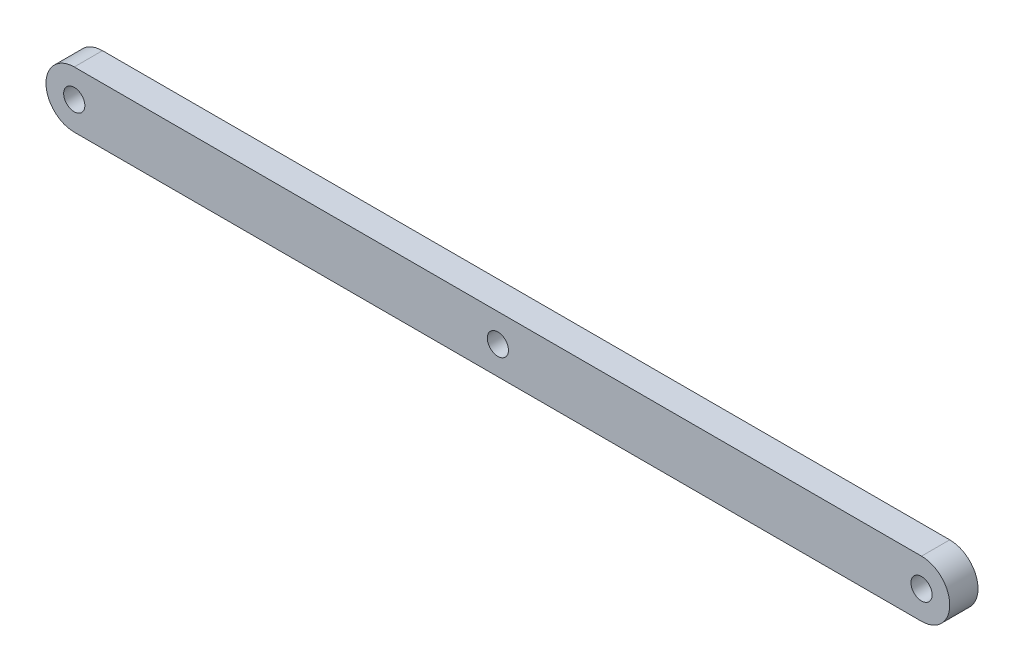
ISO-10303-21;
HEADER;
FILE_DESCRIPTION(('STEP AP214'),'2;1');
FILE_NAME('part.step','',(''),(''),'','','');
FILE_SCHEMA(('AUTOMOTIVE_DESIGN { 1 0 10303 214 1 1 1 1 }'));
ENDSEC;
DATA;
#1=APPLICATION_CONTEXT('core data for automotive mechanical design processes');
#2=APPLICATION_PROTOCOL_DEFINITION('international standard','automotive_design',2000,#1);
#3=PRODUCT_CONTEXT('',#1,'mechanical');
#4=PRODUCT('Part','Part','',(#3));
#5=PRODUCT_RELATED_PRODUCT_CATEGORY('part','',(#4));
#6=PRODUCT_DEFINITION_FORMATION('','',#4);
#7=PRODUCT_DEFINITION_CONTEXT('part definition',#1,'design');
#8=PRODUCT_DEFINITION('design','',#6,#7);
#9=PRODUCT_DEFINITION_SHAPE('','',#8);
#10=(LENGTH_UNIT() NAMED_UNIT(*) SI_UNIT(.MILLI.,.METRE.));
#11=(NAMED_UNIT(*) PLANE_ANGLE_UNIT() SI_UNIT($,.RADIAN.));
#12=(NAMED_UNIT(*) SI_UNIT($,.STERADIAN.) SOLID_ANGLE_UNIT());
#13=UNCERTAINTY_MEASURE_WITH_UNIT(LENGTH_MEASURE(1.E-05),#10,'distance_accuracy_value','');
#14=(GEOMETRIC_REPRESENTATION_CONTEXT(3) GLOBAL_UNCERTAINTY_ASSIGNED_CONTEXT((#13)) GLOBAL_UNIT_ASSIGNED_CONTEXT((#10,
#11,#12)) REPRESENTATION_CONTEXT('',''));
#15=CARTESIAN_POINT('',(0.,0.,0.));
#16=DIRECTION('',(0.,0.,1.));
#17=DIRECTION('',(1.,0.,0.));
#18=AXIS2_PLACEMENT_3D('',#15,#16,#17);
#19=CARTESIAN_POINT('',(0.,20.,-20.));
#20=DIRECTION('',(0.,0.,1.));
#21=DIRECTION('',(1.,0.,0.));
#22=AXIS2_PLACEMENT_3D('',#19,#20,#21);
#23=CYLINDRICAL_SURFACE('',#22,20.);
#24=CARTESIAN_POINT('',(0.,20.,0.));
#25=DIRECTION('',(0.,0.,1.));
#26=DIRECTION('',(1.,0.,0.));
#27=AXIS2_PLACEMENT_3D('',#24,#25,#26);
#28=CIRCLE('',#27,20.);
#29=CARTESIAN_POINT('',(0.,40.,0.));
#30=VERTEX_POINT('',#29);
#31=CARTESIAN_POINT('',(0.,0.,0.));
#32=VERTEX_POINT('',#31);
#33=EDGE_CURVE('E84',#30,#32,#28,.T.);
#34=ORIENTED_EDGE('',*,*,#33,.F.);
#35=DIRECTION('',(0.,0.,1.));
#36=VECTOR('',#35,1.);
#37=CARTESIAN_POINT('',(0.,40.,-20.));
#38=LINE('',#37,#36);
#39=CARTESIAN_POINT('',(0.,40.,-20.));
#40=VERTEX_POINT('',#39);
#41=EDGE_CURVE('E11',#40,#30,#38,.T.);
#42=ORIENTED_EDGE('',*,*,#41,.F.);
#43=CARTESIAN_POINT('',(0.,20.,-20.));
#44=DIRECTION('',(0.,0.,1.));
#45=DIRECTION('',(1.,0.,0.));
#46=AXIS2_PLACEMENT_3D('',#43,#44,#45);
#47=CIRCLE('',#46,20.);
#48=CARTESIAN_POINT('',(0.,0.,-20.));
#49=VERTEX_POINT('',#48);
#50=EDGE_CURVE('E77',#40,#49,#47,.T.);
#51=ORIENTED_EDGE('',*,*,#50,.T.);
#52=DIRECTION('',(0.,0.,1.));
#53=VECTOR('',#52,1.);
#54=CARTESIAN_POINT('',(0.,0.,-20.));
#55=LINE('',#54,#53);
#56=EDGE_CURVE('E22',#49,#32,#55,.T.);
#57=ORIENTED_EDGE('',*,*,#56,.T.);
#58=EDGE_LOOP('',(#34,#42,#51,#57));
#59=FACE_BOUND('',#58,.T.);
#60=ADVANCED_FACE('F19',(#59),#23,.T.);
#61=CARTESIAN_POINT('',(0.,40.,-20.));
#62=DIRECTION('',(0.,1.,0.));
#63=DIRECTION('',(0.,0.,1.));
#64=AXIS2_PLACEMENT_3D('',#61,#62,#63);
#65=PLANE('',#64);
#66=DIRECTION('',(-1.,0.,0.));
#67=VECTOR('',#66,1.);
#68=CARTESIAN_POINT('',(0.,40.,0.));
#69=LINE('',#68,#67);
#70=CARTESIAN_POINT('',(600.,40.,0.));
#71=VERTEX_POINT('',#70);
#72=EDGE_CURVE('E79',#71,#30,#69,.T.);
#73=ORIENTED_EDGE('',*,*,#72,.F.);
#74=DIRECTION('',(0.,0.,1.));
#75=VECTOR('',#74,1.);
#76=CARTESIAN_POINT('',(600.,40.,-20.));
#77=LINE('',#76,#75);
#78=CARTESIAN_POINT('',(600.,40.,-20.));
#79=VERTEX_POINT('',#78);
#80=EDGE_CURVE('E28',#79,#71,#77,.T.);
#81=ORIENTED_EDGE('',*,*,#80,.F.);
#82=DIRECTION('',(-1.,0.,0.));
#83=VECTOR('',#82,1.);
#84=CARTESIAN_POINT('',(0.,40.,-20.));
#85=LINE('',#84,#83);
#86=EDGE_CURVE('E74',#79,#40,#85,.T.);
#87=ORIENTED_EDGE('',*,*,#86,.T.);
#88=ORIENTED_EDGE('',*,*,#41,.T.);
#89=EDGE_LOOP('',(#73,#81,#87,#88));
#90=FACE_BOUND('',#89,.T.);
#91=ADVANCED_FACE('F95',(#90),#65,.T.);
#92=CARTESIAN_POINT('',(600.,20.,-20.));
#93=DIRECTION('',(0.,0.,1.));
#94=DIRECTION('',(1.,0.,0.));
#95=AXIS2_PLACEMENT_3D('',#92,#93,#94);
#96=CYLINDRICAL_SURFACE('',#95,20.);
#97=CARTESIAN_POINT('',(600.,20.,0.));
#98=DIRECTION('',(0.,0.,1.));
#99=DIRECTION('',(1.,0.,0.));
#100=AXIS2_PLACEMENT_3D('',#97,#98,#99);
#101=CIRCLE('',#100,20.);
#102=CARTESIAN_POINT('',(600.,0.,0.));
#103=VERTEX_POINT('',#102);
#104=EDGE_CURVE('E69',#103,#71,#101,.T.);
#105=ORIENTED_EDGE('',*,*,#104,.F.);
#106=DIRECTION('',(0.,0.,1.));
#107=VECTOR('',#106,1.);
#108=CARTESIAN_POINT('',(600.,0.,-20.));
#109=LINE('',#108,#107);
#110=CARTESIAN_POINT('',(600.,0.,-20.));
#111=VERTEX_POINT('',#110);
#112=EDGE_CURVE('E64',#111,#103,#109,.T.);
#113=ORIENTED_EDGE('',*,*,#112,.F.);
#114=CARTESIAN_POINT('',(600.,20.,-20.));
#115=DIRECTION('',(0.,0.,1.));
#116=DIRECTION('',(1.,0.,0.));
#117=AXIS2_PLACEMENT_3D('',#114,#115,#116);
#118=CIRCLE('',#117,20.);
#119=EDGE_CURVE('E67',#111,#79,#118,.T.);
#120=ORIENTED_EDGE('',*,*,#119,.T.);
#121=ORIENTED_EDGE('',*,*,#80,.T.);
#122=EDGE_LOOP('',(#105,#113,#120,#121));
#123=FACE_BOUND('',#122,.T.);
#124=ADVANCED_FACE('F66',(#123),#96,.T.);
#125=CARTESIAN_POINT('',(0.,0.,-20.));
#126=DIRECTION('',(0.,-1.,0.));
#127=DIRECTION('',(0.,0.,-1.));
#128=AXIS2_PLACEMENT_3D('',#125,#126,#127);
#129=PLANE('',#128);
#130=DIRECTION('',(1.,0.,0.));
#131=VECTOR('',#130,1.);
#132=CARTESIAN_POINT('',(0.,0.,0.));
#133=LINE('',#132,#131);
#134=EDGE_CURVE('E87',#32,#103,#133,.T.);
#135=ORIENTED_EDGE('',*,*,#134,.F.);
#136=ORIENTED_EDGE('',*,*,#56,.F.);
#137=DIRECTION('',(1.,0.,0.));
#138=VECTOR('',#137,1.);
#139=CARTESIAN_POINT('',(0.,0.,-20.));
#140=LINE('',#139,#138);
#141=EDGE_CURVE('E73',#49,#111,#140,.T.);
#142=ORIENTED_EDGE('',*,*,#141,.T.);
#143=ORIENTED_EDGE('',*,*,#112,.T.);
#144=EDGE_LOOP('',(#135,#136,#142,#143));
#145=FACE_BOUND('',#144,.T.);
#146=ADVANCED_FACE('F76',(#145),#129,.T.);
#147=CARTESIAN_POINT('',(0.,20.,-20.));
#148=DIRECTION('',(0.,0.,1.));
#149=DIRECTION('',(1.,0.,0.));
#150=AXIS2_PLACEMENT_3D('',#147,#148,#149);
#151=PLANE('',#150);
#152=CARTESIAN_POINT('',(300.,20.,-20.));
#153=DIRECTION('',(0.,0.,1.));
#154=DIRECTION('',(1.,0.,0.));
#155=AXIS2_PLACEMENT_3D('',#152,#153,#154);
#156=CIRCLE('',#155,7.5);
#157=CARTESIAN_POINT('',(307.5,20.,-20.));
#158=VERTEX_POINT('',#157);
#159=EDGE_CURVE('E137',#158,#158,#156,.T.);
#160=ORIENTED_EDGE('',*,*,#159,.T.);
#161=EDGE_LOOP('',(#160));
#162=FACE_BOUND('',#161,.T.);
#163=CARTESIAN_POINT('',(600.,20.,-20.));
#164=DIRECTION('',(0.,0.,1.));
#165=DIRECTION('',(1.,0.,0.));
#166=AXIS2_PLACEMENT_3D('',#163,#164,#165);
#167=CIRCLE('',#166,7.5);
#168=CARTESIAN_POINT('',(607.5,20.,-20.));
#169=VERTEX_POINT('',#168);
#170=EDGE_CURVE('E145',#169,#169,#167,.T.);
#171=ORIENTED_EDGE('',*,*,#170,.T.);
#172=EDGE_LOOP('',(#171));
#173=FACE_BOUND('',#172,.T.);
#174=CARTESIAN_POINT('',(0.,20.,-20.));
#175=DIRECTION('',(0.,0.,1.));
#176=DIRECTION('',(1.,0.,0.));
#177=AXIS2_PLACEMENT_3D('',#174,#175,#176);
#178=CIRCLE('',#177,7.5);
#179=CARTESIAN_POINT('',(7.5,20.,-20.));
#180=VERTEX_POINT('',#179);
#181=EDGE_CURVE('E88',#180,#180,#178,.T.);
#182=ORIENTED_EDGE('',*,*,#181,.T.);
#183=EDGE_LOOP('',(#182));
#184=FACE_BOUND('',#183,.T.);
#185=ORIENTED_EDGE('',*,*,#50,.F.);
#186=ORIENTED_EDGE('',*,*,#86,.F.);
#187=ORIENTED_EDGE('',*,*,#119,.F.);
#188=ORIENTED_EDGE('',*,*,#141,.F.);
#189=EDGE_LOOP('',(#185,#186,#187,#188));
#190=FACE_BOUND('',#189,.T.);
#191=ADVANCED_FACE('F72',(#162,#173,#184,#190),#151,.F.);
#192=CARTESIAN_POINT('',(0.,20.,0.));
#193=DIRECTION('',(0.,0.,1.));
#194=DIRECTION('',(1.,0.,0.));
#195=AXIS2_PLACEMENT_3D('',#192,#193,#194);
#196=PLANE('',#195);
#197=CARTESIAN_POINT('',(300.,20.,0.));
#198=DIRECTION('',(0.,0.,1.));
#199=DIRECTION('',(1.,0.,0.));
#200=AXIS2_PLACEMENT_3D('',#197,#198,#199);
#201=CIRCLE('',#200,7.5);
#202=CARTESIAN_POINT('',(307.5,20.,0.));
#203=VERTEX_POINT('',#202);
#204=EDGE_CURVE('E140',#203,#203,#201,.T.);
#205=ORIENTED_EDGE('',*,*,#204,.F.);
#206=EDGE_LOOP('',(#205));
#207=FACE_BOUND('',#206,.T.);
#208=CARTESIAN_POINT('',(600.,20.,0.));
#209=DIRECTION('',(0.,0.,1.));
#210=DIRECTION('',(1.,0.,0.));
#211=AXIS2_PLACEMENT_3D('',#208,#209,#210);
#212=CIRCLE('',#211,7.5);
#213=CARTESIAN_POINT('',(607.5,20.,0.));
#214=VERTEX_POINT('',#213);
#215=EDGE_CURVE('E142',#214,#214,#212,.T.);
#216=ORIENTED_EDGE('',*,*,#215,.F.);
#217=EDGE_LOOP('',(#216));
#218=FACE_BOUND('',#217,.T.);
#219=CARTESIAN_POINT('',(0.,20.,0.));
#220=DIRECTION('',(0.,0.,1.));
#221=DIRECTION('',(1.,0.,0.));
#222=AXIS2_PLACEMENT_3D('',#219,#220,#221);
#223=CIRCLE('',#222,7.5);
#224=CARTESIAN_POINT('',(7.5,20.,0.));
#225=VERTEX_POINT('',#224);
#226=EDGE_CURVE('E148',#225,#225,#223,.T.);
#227=ORIENTED_EDGE('',*,*,#226,.F.);
#228=EDGE_LOOP('',(#227));
#229=FACE_BOUND('',#228,.T.);
#230=ORIENTED_EDGE('',*,*,#33,.T.);
#231=ORIENTED_EDGE('',*,*,#134,.T.);
#232=ORIENTED_EDGE('',*,*,#104,.T.);
#233=ORIENTED_EDGE('',*,*,#72,.T.);
#234=EDGE_LOOP('',(#230,#231,#232,#233));
#235=FACE_BOUND('',#234,.T.);
#236=ADVANCED_FACE('F94',(#207,#218,#229,#235),#196,.T.);
#237=CARTESIAN_POINT('',(0.,20.,-20.));
#238=DIRECTION('',(0.,0.,1.));
#239=DIRECTION('',(1.,0.,0.));
#240=AXIS2_PLACEMENT_3D('',#237,#238,#239);
#241=CYLINDRICAL_SURFACE('',#240,7.5);
#242=ORIENTED_EDGE('',*,*,#181,.F.);
#243=EDGE_LOOP('',(#242));
#244=FACE_BOUND('',#243,.T.);
#245=ORIENTED_EDGE('',*,*,#226,.T.);
#246=EDGE_LOOP('',(#245));
#247=FACE_BOUND('',#246,.T.);
#248=ADVANCED_FACE('F117',(#244,#247),#241,.F.);
#249=CARTESIAN_POINT('',(600.,20.,-20.));
#250=DIRECTION('',(0.,0.,1.));
#251=DIRECTION('',(1.,0.,0.));
#252=AXIS2_PLACEMENT_3D('',#249,#250,#251);
#253=CYLINDRICAL_SURFACE('',#252,7.5);
#254=ORIENTED_EDGE('',*,*,#170,.F.);
#255=EDGE_LOOP('',(#254));
#256=FACE_BOUND('',#255,.T.);
#257=ORIENTED_EDGE('',*,*,#215,.T.);
#258=EDGE_LOOP('',(#257));
#259=FACE_BOUND('',#258,.T.);
#260=ADVANCED_FACE('F124',(#256,#259),#253,.F.);
#261=CARTESIAN_POINT('',(300.,20.,-20.));
#262=DIRECTION('',(0.,0.,1.));
#263=DIRECTION('',(1.,0.,0.));
#264=AXIS2_PLACEMENT_3D('',#261,#262,#263);
#265=CYLINDRICAL_SURFACE('',#264,7.5);
#266=ORIENTED_EDGE('',*,*,#159,.F.);
#267=EDGE_LOOP('',(#266));
#268=FACE_BOUND('',#267,.T.);
#269=ORIENTED_EDGE('',*,*,#204,.T.);
#270=EDGE_LOOP('',(#269));
#271=FACE_BOUND('',#270,.T.);
#272=ADVANCED_FACE('F128',(#268,#271),#265,.F.);
#273=CLOSED_SHELL('',(#60,#91,#124,#146,#191,#236,#248,#260,#272));
#274=MANIFOLD_SOLID_BREP('B1',#273);
#275=ADVANCED_BREP_SHAPE_REPRESENTATION('',(#18,#274),#14);
#276=SHAPE_DEFINITION_REPRESENTATION(#9,#275);
ENDSEC;
END-ISO-10303-21;
